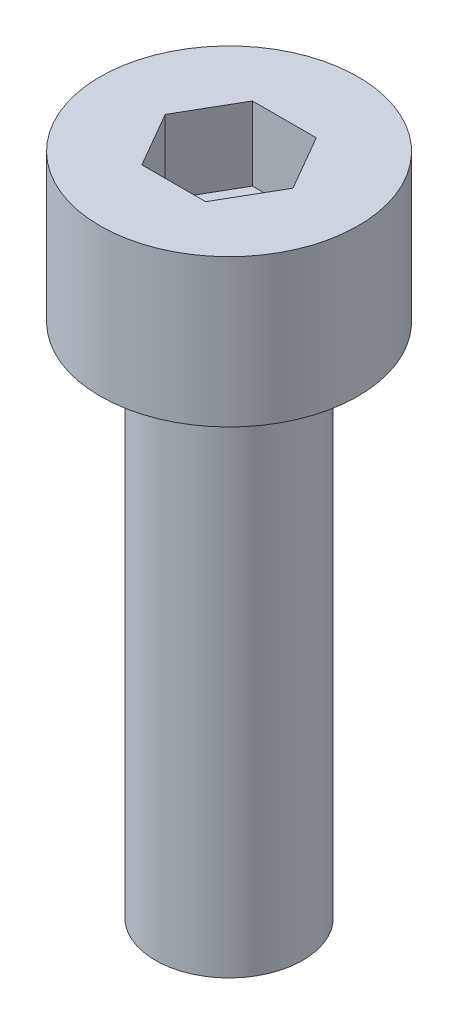
ISO-10303-21;
HEADER;
FILE_DESCRIPTION(('STEP AP214'),'2;1');
FILE_NAME('part.step','',(''),(''),'','','');
FILE_SCHEMA(('AUTOMOTIVE_DESIGN { 1 0 10303 214 1 1 1 1 }'));
ENDSEC;
DATA;
#1=APPLICATION_CONTEXT('core data for automotive mechanical design processes');
#2=APPLICATION_PROTOCOL_DEFINITION('international standard','automotive_design',2000,#1);
#3=PRODUCT_CONTEXT('',#1,'mechanical');
#4=PRODUCT('Part','Part','',(#3));
#5=PRODUCT_RELATED_PRODUCT_CATEGORY('part','',(#4));
#6=PRODUCT_DEFINITION_FORMATION('','',#4);
#7=PRODUCT_DEFINITION_CONTEXT('part definition',#1,'design');
#8=PRODUCT_DEFINITION('design','',#6,#7);
#9=PRODUCT_DEFINITION_SHAPE('','',#8);
#10=(LENGTH_UNIT() NAMED_UNIT(*) SI_UNIT(.MILLI.,.METRE.));
#11=(NAMED_UNIT(*) PLANE_ANGLE_UNIT() SI_UNIT($,.RADIAN.));
#12=(NAMED_UNIT(*) SI_UNIT($,.STERADIAN.) SOLID_ANGLE_UNIT());
#13=UNCERTAINTY_MEASURE_WITH_UNIT(LENGTH_MEASURE(1.E-05),#10,'distance_accuracy_value','');
#14=(GEOMETRIC_REPRESENTATION_CONTEXT(3) GLOBAL_UNCERTAINTY_ASSIGNED_CONTEXT((#13)) GLOBAL_UNIT_ASSIGNED_CONTEXT((#10,
#11,#12)) REPRESENTATION_CONTEXT('',''));
#15=CARTESIAN_POINT('',(0.,0.,0.));
#16=DIRECTION('',(0.,0.,1.));
#17=DIRECTION('',(1.,0.,0.));
#18=AXIS2_PLACEMENT_3D('',#15,#16,#17);
#19=CARTESIAN_POINT('',(0.,4.,0.));
#20=DIRECTION('',(0.,-1.,0.));
#21=DIRECTION('',(0.,0.,-1.));
#22=AXIS2_PLACEMENT_3D('',#19,#20,#21);
#23=CYLINDRICAL_SURFACE('',#22,3.5);
#24=CARTESIAN_POINT('',(0.,4.,0.));
#25=DIRECTION('',(0.,1.,0.));
#26=DIRECTION('',(0.,0.,1.));
#27=AXIS2_PLACEMENT_3D('',#24,#25,#26);
#28=CIRCLE('',#27,3.5);
#29=CARTESIAN_POINT('',(0.,4.,3.5));
#30=VERTEX_POINT('',#29);
#31=EDGE_CURVE('E42',#30,#30,#28,.T.);
#32=ORIENTED_EDGE('',*,*,#31,.F.);
#33=EDGE_LOOP('',(#32));
#34=FACE_BOUND('',#33,.T.);
#35=CARTESIAN_POINT('',(0.,0.,0.));
#36=DIRECTION('',(0.,1.,0.));
#37=DIRECTION('',(0.,0.,1.));
#38=AXIS2_PLACEMENT_3D('',#35,#36,#37);
#39=CIRCLE('',#38,3.5);
#40=CARTESIAN_POINT('',(0.,0.,3.5));
#41=VERTEX_POINT('',#40);
#42=EDGE_CURVE('E37',#41,#41,#39,.T.);
#43=ORIENTED_EDGE('',*,*,#42,.T.);
#44=EDGE_LOOP('',(#43));
#45=FACE_BOUND('',#44,.T.);
#46=ADVANCED_FACE('F34',(#34,#45),#23,.T.);
#47=CARTESIAN_POINT('',(0.,4.,0.));
#48=DIRECTION('',(0.,1.,0.));
#49=DIRECTION('',(0.,0.,1.));
#50=AXIS2_PLACEMENT_3D('',#47,#48,#49);
#51=PLANE('',#50);
#52=DIRECTION('',(0.5,0.,-0.866025403784439));
#53=VECTOR('',#52,1.);
#54=CARTESIAN_POINT('',(0.866025403784438,4.,1.5));
#55=LINE('',#54,#53);
#56=CARTESIAN_POINT('',(0.866025403784438,4.,1.5));
#57=VERTEX_POINT('',#56);
#58=CARTESIAN_POINT('',(1.73205080756888,4.,0.));
#59=VERTEX_POINT('',#58);
#60=EDGE_CURVE('E50',#57,#59,#55,.T.);
#61=ORIENTED_EDGE('',*,*,#60,.F.);
#62=DIRECTION('',(1.,0.,0.));
#63=VECTOR('',#62,1.);
#64=CARTESIAN_POINT('',(-0.866025403784439,4.,1.5));
#65=LINE('',#64,#63);
#66=CARTESIAN_POINT('',(-0.866025403784439,4.,1.5));
#67=VERTEX_POINT('',#66);
#68=EDGE_CURVE('E134',#67,#57,#65,.T.);
#69=ORIENTED_EDGE('',*,*,#68,.F.);
#70=DIRECTION('',(0.5,0.,0.866025403784438));
#71=VECTOR('',#70,1.);
#72=CARTESIAN_POINT('',(-1.73205080756888,4.,0.));
#73=LINE('',#72,#71);
#74=CARTESIAN_POINT('',(-1.73205080756888,4.,0.));
#75=VERTEX_POINT('',#74);
#76=EDGE_CURVE('E132',#75,#67,#73,.T.);
#77=ORIENTED_EDGE('',*,*,#76,.F.);
#78=DIRECTION('',(-0.5,0.,0.866025403784439));
#79=VECTOR('',#78,1.);
#80=CARTESIAN_POINT('',(-0.866025403784439,4.,-1.5));
#81=LINE('',#80,#79);
#82=CARTESIAN_POINT('',(-0.866025403784439,4.,-1.5));
#83=VERTEX_POINT('',#82);
#84=EDGE_CURVE('E98',#83,#75,#81,.T.);
#85=ORIENTED_EDGE('',*,*,#84,.F.);
#86=DIRECTION('',(-1.,0.,0.));
#87=VECTOR('',#86,1.);
#88=CARTESIAN_POINT('',(0.866025403784438,4.,-1.5));
#89=LINE('',#88,#87);
#90=CARTESIAN_POINT('',(0.866025403784438,4.,-1.5));
#91=VERTEX_POINT('',#90);
#92=EDGE_CURVE('E128',#91,#83,#89,.T.);
#93=ORIENTED_EDGE('',*,*,#92,.F.);
#94=DIRECTION('',(-0.5,0.,-0.866025403784439));
#95=VECTOR('',#94,1.);
#96=CARTESIAN_POINT('',(1.73205080756888,4.,0.));
#97=LINE('',#96,#95);
#98=EDGE_CURVE('E124',#59,#91,#97,.T.);
#99=ORIENTED_EDGE('',*,*,#98,.F.);
#100=EDGE_LOOP('',(#61,#69,#77,#85,#93,#99));
#101=FACE_BOUND('',#100,.T.);
#102=ORIENTED_EDGE('',*,*,#31,.T.);
#103=EDGE_LOOP('',(#102));
#104=FACE_BOUND('',#103,.T.);
#105=ADVANCED_FACE('F152',(#101,#104),#51,.T.);
#106=CARTESIAN_POINT('',(0.,0.,0.));
#107=DIRECTION('',(0.,1.,0.));
#108=DIRECTION('',(0.,0.,1.));
#109=AXIS2_PLACEMENT_3D('',#106,#107,#108);
#110=PLANE('',#109);
#111=CARTESIAN_POINT('',(0.,0.,0.));
#112=DIRECTION('',(0.,-1.,0.));
#113=DIRECTION('',(0.,0.,-1.));
#114=AXIS2_PLACEMENT_3D('',#111,#112,#113);
#115=CIRCLE('',#114,2.);
#116=CARTESIAN_POINT('',(0.,0.,-2.));
#117=VERTEX_POINT('',#116);
#118=EDGE_CURVE('E11',#117,#117,#115,.T.);
#119=ORIENTED_EDGE('',*,*,#118,.F.);
#120=EDGE_LOOP('',(#119));
#121=FACE_BOUND('',#120,.T.);
#122=ORIENTED_EDGE('',*,*,#42,.F.);
#123=EDGE_LOOP('',(#122));
#124=FACE_BOUND('',#123,.T.);
#125=ADVANCED_FACE('F149',(#121,#124),#110,.F.);
#126=CARTESIAN_POINT('',(0.866025403784438,2.,1.5));
#127=DIRECTION('',(0.866025403784439,0.,0.5));
#128=DIRECTION('',(0.5,0.,-0.866025403784439));
#129=AXIS2_PLACEMENT_3D('',#126,#127,#128);
#130=PLANE('',#129);
#131=ORIENTED_EDGE('',*,*,#60,.T.);
#132=DIRECTION('',(0.,1.,0.));
#133=VECTOR('',#132,1.);
#134=CARTESIAN_POINT('',(1.73205080756888,2.,0.));
#135=LINE('',#134,#133);
#136=CARTESIAN_POINT('',(1.73205080756888,2.,0.));
#137=VERTEX_POINT('',#136);
#138=EDGE_CURVE('E80',#137,#59,#135,.T.);
#139=ORIENTED_EDGE('',*,*,#138,.F.);
#140=DIRECTION('',(0.5,0.,-0.866025403784439));
#141=VECTOR('',#140,1.);
#142=CARTESIAN_POINT('',(0.866025403784438,2.,1.5));
#143=LINE('',#142,#141);
#144=CARTESIAN_POINT('',(0.866025403784438,2.,1.5));
#145=VERTEX_POINT('',#144);
#146=EDGE_CURVE('E136',#145,#137,#143,.T.);
#147=ORIENTED_EDGE('',*,*,#146,.F.);
#148=DIRECTION('',(0.,1.,0.));
#149=VECTOR('',#148,1.);
#150=CARTESIAN_POINT('',(0.866025403784438,2.,1.5));
#151=LINE('',#150,#149);
#152=EDGE_CURVE('E58',#145,#57,#151,.T.);
#153=ORIENTED_EDGE('',*,*,#152,.T.);
#154=EDGE_LOOP('',(#131,#139,#147,#153));
#155=FACE_BOUND('',#154,.T.);
#156=ADVANCED_FACE('F151',(#155),#130,.F.);
#157=CARTESIAN_POINT('',(-0.866025403784439,2.,1.5));
#158=DIRECTION('',(0.,0.,1.));
#159=DIRECTION('',(1.,0.,0.));
#160=AXIS2_PLACEMENT_3D('',#157,#158,#159);
#161=PLANE('',#160);
#162=ORIENTED_EDGE('',*,*,#68,.T.);
#163=ORIENTED_EDGE('',*,*,#152,.F.);
#164=DIRECTION('',(1.,0.,0.));
#165=VECTOR('',#164,1.);
#166=CARTESIAN_POINT('',(-0.866025403784439,2.,1.5));
#167=LINE('',#166,#165);
#168=CARTESIAN_POINT('',(-0.866025403784439,2.,1.5));
#169=VERTEX_POINT('',#168);
#170=EDGE_CURVE('E110',#169,#145,#167,.T.);
#171=ORIENTED_EDGE('',*,*,#170,.F.);
#172=DIRECTION('',(0.,1.,0.));
#173=VECTOR('',#172,1.);
#174=CARTESIAN_POINT('',(-0.866025403784439,2.,1.5));
#175=LINE('',#174,#173);
#176=EDGE_CURVE('E102',#169,#67,#175,.T.);
#177=ORIENTED_EDGE('',*,*,#176,.T.);
#178=EDGE_LOOP('',(#162,#163,#171,#177));
#179=FACE_BOUND('',#178,.T.);
#180=ADVANCED_FACE('F158',(#179),#161,.F.);
#181=CARTESIAN_POINT('',(-1.73205080756888,2.,0.));
#182=DIRECTION('',(-0.866025403784439,0.,0.5));
#183=DIRECTION('',(0.5,0.,0.866025403784438));
#184=AXIS2_PLACEMENT_3D('',#181,#182,#183);
#185=PLANE('',#184);
#186=ORIENTED_EDGE('',*,*,#76,.T.);
#187=ORIENTED_EDGE('',*,*,#176,.F.);
#188=DIRECTION('',(0.5,0.,0.866025403784438));
#189=VECTOR('',#188,1.);
#190=CARTESIAN_POINT('',(-1.73205080756888,2.,0.));
#191=LINE('',#190,#189);
#192=CARTESIAN_POINT('',(-1.73205080756888,2.,0.));
#193=VERTEX_POINT('',#192);
#194=EDGE_CURVE('E106',#193,#169,#191,.T.);
#195=ORIENTED_EDGE('',*,*,#194,.F.);
#196=DIRECTION('',(0.,1.,0.));
#197=VECTOR('',#196,1.);
#198=CARTESIAN_POINT('',(-1.73205080756888,2.,0.));
#199=LINE('',#198,#197);
#200=EDGE_CURVE('E91',#193,#75,#199,.T.);
#201=ORIENTED_EDGE('',*,*,#200,.T.);
#202=EDGE_LOOP('',(#186,#187,#195,#201));
#203=FACE_BOUND('',#202,.T.);
#204=ADVANCED_FACE('F107',(#203),#185,.F.);
#205=CARTESIAN_POINT('',(-0.866025403784439,2.,-1.5));
#206=DIRECTION('',(-0.866025403784439,0.,-0.5));
#207=DIRECTION('',(-0.5,0.,0.866025403784439));
#208=AXIS2_PLACEMENT_3D('',#205,#206,#207);
#209=PLANE('',#208);
#210=ORIENTED_EDGE('',*,*,#84,.T.);
#211=ORIENTED_EDGE('',*,*,#200,.F.);
#212=DIRECTION('',(-0.5,0.,0.866025403784439));
#213=VECTOR('',#212,1.);
#214=CARTESIAN_POINT('',(-0.866025403784439,2.,-1.5));
#215=LINE('',#214,#213);
#216=CARTESIAN_POINT('',(-0.866025403784439,2.,-1.5));
#217=VERTEX_POINT('',#216);
#218=EDGE_CURVE('E95',#217,#193,#215,.T.);
#219=ORIENTED_EDGE('',*,*,#218,.F.);
#220=DIRECTION('',(0.,1.,0.));
#221=VECTOR('',#220,1.);
#222=CARTESIAN_POINT('',(-0.866025403784439,2.,-1.5));
#223=LINE('',#222,#221);
#224=EDGE_CURVE('E103',#217,#83,#223,.T.);
#225=ORIENTED_EDGE('',*,*,#224,.T.);
#226=EDGE_LOOP('',(#210,#211,#219,#225));
#227=FACE_BOUND('',#226,.T.);
#228=ADVANCED_FACE('F93',(#227),#209,.F.);
#229=CARTESIAN_POINT('',(0.866025403784438,2.,-1.5));
#230=DIRECTION('',(0.,0.,-1.));
#231=DIRECTION('',(-1.,0.,0.));
#232=AXIS2_PLACEMENT_3D('',#229,#230,#231);
#233=PLANE('',#232);
#234=ORIENTED_EDGE('',*,*,#92,.T.);
#235=ORIENTED_EDGE('',*,*,#224,.F.);
#236=DIRECTION('',(-1.,0.,0.));
#237=VECTOR('',#236,1.);
#238=CARTESIAN_POINT('',(0.866025403784438,2.,-1.5));
#239=LINE('',#238,#237);
#240=CARTESIAN_POINT('',(0.866025403784438,2.,-1.5));
#241=VERTEX_POINT('',#240);
#242=EDGE_CURVE('E116',#241,#217,#239,.T.);
#243=ORIENTED_EDGE('',*,*,#242,.F.);
#244=DIRECTION('',(0.,1.,0.));
#245=VECTOR('',#244,1.);
#246=CARTESIAN_POINT('',(0.866025403784438,2.,-1.5));
#247=LINE('',#246,#245);
#248=EDGE_CURVE('E140',#241,#91,#247,.T.);
#249=ORIENTED_EDGE('',*,*,#248,.T.);
#250=EDGE_LOOP('',(#234,#235,#243,#249));
#251=FACE_BOUND('',#250,.T.);
#252=ADVANCED_FACE('F203',(#251),#233,.F.);
#253=CARTESIAN_POINT('',(1.73205080756888,2.,0.));
#254=DIRECTION('',(0.866025403784439,0.,-0.5));
#255=DIRECTION('',(-0.5,0.,-0.866025403784439));
#256=AXIS2_PLACEMENT_3D('',#253,#254,#255);
#257=PLANE('',#256);
#258=ORIENTED_EDGE('',*,*,#98,.T.);
#259=ORIENTED_EDGE('',*,*,#248,.F.);
#260=DIRECTION('',(-0.5,0.,-0.866025403784439));
#261=VECTOR('',#260,1.);
#262=CARTESIAN_POINT('',(1.73205080756888,2.,0.));
#263=LINE('',#262,#261);
#264=EDGE_CURVE('E118',#137,#241,#263,.T.);
#265=ORIENTED_EDGE('',*,*,#264,.F.);
#266=ORIENTED_EDGE('',*,*,#138,.T.);
#267=EDGE_LOOP('',(#258,#259,#265,#266));
#268=FACE_BOUND('',#267,.T.);
#269=ADVANCED_FACE('F212',(#268),#257,.F.);
#270=CARTESIAN_POINT('',(0.,2.,0.));
#271=DIRECTION('',(0.,1.,0.));
#272=DIRECTION('',(0.,0.,1.));
#273=AXIS2_PLACEMENT_3D('',#270,#271,#272);
#274=PLANE('',#273);
#275=ORIENTED_EDGE('',*,*,#146,.T.);
#276=ORIENTED_EDGE('',*,*,#264,.T.);
#277=ORIENTED_EDGE('',*,*,#242,.T.);
#278=ORIENTED_EDGE('',*,*,#218,.T.);
#279=ORIENTED_EDGE('',*,*,#194,.T.);
#280=ORIENTED_EDGE('',*,*,#170,.T.);
#281=EDGE_LOOP('',(#275,#276,#277,#278,#279,#280));
#282=FACE_BOUND('',#281,.T.);
#283=ADVANCED_FACE('F113',(#282),#274,.T.);
#284=CARTESIAN_POINT('',(0.,-14.,0.));
#285=DIRECTION('',(0.,1.,0.));
#286=DIRECTION('',(0.,0.,1.));
#287=AXIS2_PLACEMENT_3D('',#284,#285,#286);
#288=CYLINDRICAL_SURFACE('',#287,2.);
#289=CARTESIAN_POINT('',(0.,-14.,0.));
#290=DIRECTION('',(0.,-1.,0.));
#291=DIRECTION('',(0.,0.,-1.));
#292=AXIS2_PLACEMENT_3D('',#289,#290,#291);
#293=CIRCLE('',#292,2.);
#294=CARTESIAN_POINT('',(0.,-14.,-2.));
#295=VERTEX_POINT('',#294);
#296=EDGE_CURVE('E125',#295,#295,#293,.T.);
#297=ORIENTED_EDGE('',*,*,#296,.F.);
#298=EDGE_LOOP('',(#297));
#299=FACE_BOUND('',#298,.T.);
#300=ORIENTED_EDGE('',*,*,#118,.T.);
#301=EDGE_LOOP('',(#300));
#302=FACE_BOUND('',#301,.T.);
#303=ADVANCED_FACE('F230',(#299,#302),#288,.T.);
#304=CARTESIAN_POINT('',(0.,-14.,0.));
#305=DIRECTION('',(0.,-1.,0.));
#306=DIRECTION('',(0.,0.,-1.));
#307=AXIS2_PLACEMENT_3D('',#304,#305,#306);
#308=PLANE('',#307);
#309=ORIENTED_EDGE('',*,*,#296,.T.);
#310=EDGE_LOOP('',(#309));
#311=FACE_BOUND('',#310,.T.);
#312=ADVANCED_FACE('F243',(#311),#308,.T.);
#313=CLOSED_SHELL('',(#46,#105,#125,#156,#180,#204,#228,#252,#269,#283,#303,#312));
#314=MANIFOLD_SOLID_BREP('B2',#313);
#315=ADVANCED_BREP_SHAPE_REPRESENTATION('',(#18,#314),#14);
#316=SHAPE_DEFINITION_REPRESENTATION(#9,#315);
ENDSEC;
END-ISO-10303-21;
